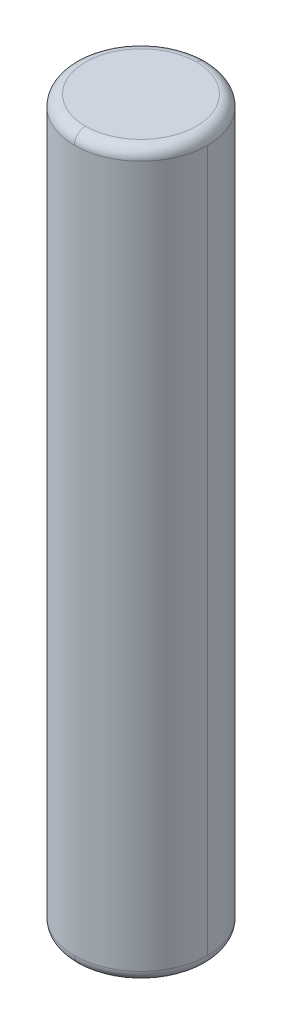
ISO-10303-21;
HEADER;
FILE_DESCRIPTION(('STEP AP214'),'2;1');
FILE_NAME('part.step','',(''),(''),'','','');
FILE_SCHEMA(('AUTOMOTIVE_DESIGN { 1 0 10303 214 1 1 1 1 }'));
ENDSEC;
DATA;
#1=APPLICATION_CONTEXT('core data for automotive mechanical design processes');
#2=APPLICATION_PROTOCOL_DEFINITION('international standard','automotive_design',2000,#1);
#3=PRODUCT_CONTEXT('',#1,'mechanical');
#4=PRODUCT('Part','Part','',(#3));
#5=PRODUCT_RELATED_PRODUCT_CATEGORY('part','',(#4));
#6=PRODUCT_DEFINITION_FORMATION('','',#4);
#7=PRODUCT_DEFINITION_CONTEXT('part definition',#1,'design');
#8=PRODUCT_DEFINITION('design','',#6,#7);
#9=PRODUCT_DEFINITION_SHAPE('','',#8);
#10=(LENGTH_UNIT() NAMED_UNIT(*) SI_UNIT(.MILLI.,.METRE.));
#11=(NAMED_UNIT(*) PLANE_ANGLE_UNIT() SI_UNIT($,.RADIAN.));
#12=(NAMED_UNIT(*) SI_UNIT($,.STERADIAN.) SOLID_ANGLE_UNIT());
#13=UNCERTAINTY_MEASURE_WITH_UNIT(LENGTH_MEASURE(1.E-05),#10,'distance_accuracy_value','');
#14=(GEOMETRIC_REPRESENTATION_CONTEXT(3) GLOBAL_UNCERTAINTY_ASSIGNED_CONTEXT((#13)) GLOBAL_UNIT_ASSIGNED_CONTEXT((#10,
#11,#12)) REPRESENTATION_CONTEXT('',''));
#15=CARTESIAN_POINT('',(0.,0.,0.));
#16=DIRECTION('',(0.,0.,1.));
#17=DIRECTION('',(1.,0.,0.));
#18=AXIS2_PLACEMENT_3D('',#15,#16,#17);
#19=CARTESIAN_POINT('',(16.2500000708053,-4.30409112274651,-11.));
#20=DIRECTION('',(0.,1.,0.));
#21=DIRECTION('',(0.,0.,1.));
#22=AXIS2_PLACEMENT_3D('',#19,#20,#21);
#23=TOROIDAL_SURFACE('',#22,1.25,0.25);
#24=CARTESIAN_POINT('',(16.2500000708053,-4.30409112274651,-12.25));
#25=DIRECTION('',(1.,0.,0.));
#26=DIRECTION('',(0.,0.,-1.));
#27=AXIS2_PLACEMENT_3D('',#24,#25,#26);
#28=CIRCLE('',#27,0.25);
#29=CARTESIAN_POINT('',(16.2500000708053,-4.30409112274651,-12.5));
#30=VERTEX_POINT('',#29);
#31=CARTESIAN_POINT('',(16.2500000708053,-4.05409112274651,-12.25));
#32=VERTEX_POINT('',#31);
#33=EDGE_CURVE('E112',#30,#32,#28,.T.);
#34=ORIENTED_EDGE('',*,*,#33,.F.);
#35=CARTESIAN_POINT('',(16.2500000708053,-4.30409112274651,-11.));
#36=DIRECTION('',(0.,1.,0.));
#37=DIRECTION('',(1.,0.,0.));
#38=AXIS2_PLACEMENT_3D('',#35,#36,#37);
#39=CIRCLE('',#38,1.5);
#40=CARTESIAN_POINT('',(14.7500000708053,-4.30409112274651,-11.));
#41=VERTEX_POINT('',#40);
#42=EDGE_CURVE('E86',#30,#41,#39,.T.);
#43=ORIENTED_EDGE('',*,*,#42,.T.);
#44=CARTESIAN_POINT('',(16.2500000708053,-4.30409112274651,-11.));
#45=DIRECTION('',(0.,1.,0.));
#46=DIRECTION('',(1.,0.,0.));
#47=AXIS2_PLACEMENT_3D('',#44,#45,#46);
#48=CIRCLE('',#47,1.5);
#49=CARTESIAN_POINT('',(16.2500000708053,-4.30409112274651,-9.5));
#50=VERTEX_POINT('',#49);
#51=EDGE_CURVE('E11',#41,#50,#48,.T.);
#52=ORIENTED_EDGE('',*,*,#51,.T.);
#53=CARTESIAN_POINT('',(16.2500000708053,-4.30409112274651,-9.75));
#54=DIRECTION('',(-1.,0.,0.));
#55=DIRECTION('',(0.,-1.,0.));
#56=AXIS2_PLACEMENT_3D('',#53,#54,#55);
#57=CIRCLE('',#56,0.25);
#58=CARTESIAN_POINT('',(16.2500000708053,-4.05409112274651,-9.75));
#59=VERTEX_POINT('',#58);
#60=EDGE_CURVE('E83',#50,#59,#57,.T.);
#61=ORIENTED_EDGE('',*,*,#60,.T.);
#62=CARTESIAN_POINT('',(16.2500000708053,-4.05409112274651,-11.));
#63=DIRECTION('',(0.,-1.,0.));
#64=DIRECTION('',(1.,0.,0.));
#65=AXIS2_PLACEMENT_3D('',#62,#63,#64);
#66=CIRCLE('',#65,1.25);
#67=EDGE_CURVE('E28',#59,#32,#66,.T.);
#68=ORIENTED_EDGE('',*,*,#67,.T.);
#69=EDGE_LOOP('',(#34,#43,#52,#61,#68));
#70=FACE_BOUND('',#69,.T.);
#71=ADVANCED_FACE('F17',(#70),#23,.T.);
#72=CARTESIAN_POINT('',(16.2500000708053,-25.2,-11.));
#73=DIRECTION('',(0.,1.,0.));
#74=DIRECTION('',(1.,0.,0.));
#75=AXIS2_PLACEMENT_3D('',#72,#73,#74);
#76=CYLINDRICAL_SURFACE('',#75,1.5);
#77=DIRECTION('',(0.,1.,0.));
#78=VECTOR('',#77,1.);
#79=CARTESIAN_POINT('',(14.7500000708053,-25.2,-11.));
#80=LINE('',#79,#78);
#81=CARTESIAN_POINT('',(14.7500000708053,-20.1040909633041,-11.));
#82=VERTEX_POINT('',#81);
#83=EDGE_CURVE('E125',#82,#41,#80,.T.);
#84=ORIENTED_EDGE('',*,*,#83,.F.);
#85=CARTESIAN_POINT('',(16.2500000708053,-20.1040909633041,-11.));
#86=DIRECTION('',(0.,-1.,0.));
#87=DIRECTION('',(1.,0.,0.));
#88=AXIS2_PLACEMENT_3D('',#85,#86,#87);
#89=CIRCLE('',#88,1.5);
#90=CARTESIAN_POINT('',(16.2500000708053,-20.1040909633041,-9.5));
#91=VERTEX_POINT('',#90);
#92=EDGE_CURVE('E118',#91,#82,#89,.T.);
#93=ORIENTED_EDGE('',*,*,#92,.F.);
#94=CARTESIAN_POINT('',(16.2500000708053,-20.1040909633041,-11.));
#95=DIRECTION('',(0.,-1.,0.));
#96=DIRECTION('',(1.,0.,0.));
#97=AXIS2_PLACEMENT_3D('',#94,#95,#96);
#98=CIRCLE('',#97,1.5);
#99=CARTESIAN_POINT('',(17.7500000708053,-20.1040909633041,-11.));
#100=VERTEX_POINT('',#99);
#101=EDGE_CURVE('E145',#100,#91,#98,.T.);
#102=ORIENTED_EDGE('',*,*,#101,.F.);
#103=DIRECTION('',(0.,1.,0.));
#104=VECTOR('',#103,1.);
#105=CARTESIAN_POINT('',(17.7500000708053,-25.2,-11.));
#106=LINE('',#105,#104);
#107=CARTESIAN_POINT('',(17.7500000708053,-4.30409112274651,-11.));
#108=VERTEX_POINT('',#107);
#109=EDGE_CURVE('E94',#100,#108,#106,.T.);
#110=ORIENTED_EDGE('',*,*,#109,.T.);
#111=CARTESIAN_POINT('',(16.2500000708053,-4.30409112274651,-11.));
#112=DIRECTION('',(0.,1.,0.));
#113=DIRECTION('',(1.,0.,0.));
#114=AXIS2_PLACEMENT_3D('',#111,#112,#113);
#115=CIRCLE('',#114,1.5);
#116=EDGE_CURVE('E91',#50,#108,#115,.T.);
#117=ORIENTED_EDGE('',*,*,#116,.F.);
#118=ORIENTED_EDGE('',*,*,#51,.F.);
#119=EDGE_LOOP('',(#84,#93,#102,#110,#117,#118));
#120=FACE_BOUND('',#119,.T.);
#121=ADVANCED_FACE('F92',(#120),#76,.T.);
#122=CARTESIAN_POINT('',(16.2500000708053,-4.05409112274651,-11.));
#123=DIRECTION('',(0.,-1.,0.));
#124=DIRECTION('',(-1.,0.,0.));
#125=AXIS2_PLACEMENT_3D('',#122,#123,#124);
#126=PLANE('',#125);
#127=ORIENTED_EDGE('',*,*,#67,.F.);
#128=CARTESIAN_POINT('',(16.2500000708053,-4.05409112274651,-11.));
#129=DIRECTION('',(0.,-1.,0.));
#130=DIRECTION('',(1.,0.,0.));
#131=AXIS2_PLACEMENT_3D('',#128,#129,#130);
#132=CIRCLE('',#131,1.25);
#133=EDGE_CURVE('E104',#32,#59,#132,.T.);
#134=ORIENTED_EDGE('',*,*,#133,.F.);
#135=EDGE_LOOP('',(#127,#134));
#136=FACE_BOUND('',#135,.T.);
#137=ADVANCED_FACE('F249',(#136),#126,.F.);
#138=CARTESIAN_POINT('',(16.2500000708053,-20.1040909633041,-11.));
#139=DIRECTION('',(0.,-1.,0.));
#140=DIRECTION('',(0.,0.,-1.));
#141=AXIS2_PLACEMENT_3D('',#138,#139,#140);
#142=TOROIDAL_SURFACE('',#141,1.25,0.25);
#143=CARTESIAN_POINT('',(16.2500000708053,-20.1040909633041,-9.75));
#144=DIRECTION('',(1.,0.,0.));
#145=DIRECTION('',(0.,0.,-1.));
#146=AXIS2_PLACEMENT_3D('',#143,#144,#145);
#147=CIRCLE('',#146,0.25);
#148=CARTESIAN_POINT('',(16.2500000708053,-20.354090963304,-9.75));
#149=VERTEX_POINT('',#148);
#150=EDGE_CURVE('E116',#91,#149,#147,.T.);
#151=ORIENTED_EDGE('',*,*,#150,.F.);
#152=ORIENTED_EDGE('',*,*,#92,.T.);
#153=CARTESIAN_POINT('',(16.2500000708053,-20.1040909633041,-11.));
#154=DIRECTION('',(0.,-1.,0.));
#155=DIRECTION('',(1.,0.,0.));
#156=AXIS2_PLACEMENT_3D('',#153,#154,#155);
#157=CIRCLE('',#156,1.5);
#158=CARTESIAN_POINT('',(16.2500000708053,-20.1040909633041,-12.5));
#159=VERTEX_POINT('',#158);
#160=EDGE_CURVE('E99',#82,#159,#157,.T.);
#161=ORIENTED_EDGE('',*,*,#160,.T.);
#162=CARTESIAN_POINT('',(16.2500000708053,-20.1040909633041,-12.25));
#163=DIRECTION('',(-1.,0.,0.));
#164=DIRECTION('',(0.,-1.,0.));
#165=AXIS2_PLACEMENT_3D('',#162,#163,#164);
#166=CIRCLE('',#165,0.25);
#167=CARTESIAN_POINT('',(16.2500000708053,-20.354090963304,-12.25));
#168=VERTEX_POINT('',#167);
#169=EDGE_CURVE('E127',#159,#168,#166,.T.);
#170=ORIENTED_EDGE('',*,*,#169,.T.);
#171=CARTESIAN_POINT('',(16.2500000708053,-20.354090963304,-11.));
#172=DIRECTION('',(0.,1.,0.));
#173=DIRECTION('',(1.,0.,0.));
#174=AXIS2_PLACEMENT_3D('',#171,#172,#173);
#175=CIRCLE('',#174,1.25);
#176=EDGE_CURVE('E21',#168,#149,#175,.T.);
#177=ORIENTED_EDGE('',*,*,#176,.T.);
#178=EDGE_LOOP('',(#151,#152,#161,#170,#177));
#179=FACE_BOUND('',#178,.T.);
#180=ADVANCED_FACE('F19',(#179),#142,.T.);
#181=CARTESIAN_POINT('',(16.2500000708053,-20.354090963304,-11.));
#182=DIRECTION('',(0.,-1.,0.));
#183=DIRECTION('',(-1.,0.,0.));
#184=AXIS2_PLACEMENT_3D('',#181,#182,#183);
#185=PLANE('',#184);
#186=ORIENTED_EDGE('',*,*,#176,.F.);
#187=CARTESIAN_POINT('',(16.2500000708053,-20.354090963304,-11.));
#188=DIRECTION('',(0.,1.,0.));
#189=DIRECTION('',(1.,0.,0.));
#190=AXIS2_PLACEMENT_3D('',#187,#188,#189);
#191=CIRCLE('',#190,1.25);
#192=EDGE_CURVE('E129',#149,#168,#191,.T.);
#193=ORIENTED_EDGE('',*,*,#192,.F.);
#194=EDGE_LOOP('',(#186,#193));
#195=FACE_BOUND('',#194,.T.);
#196=ADVANCED_FACE('F223',(#195),#185,.T.);
#197=CARTESIAN_POINT('',(16.2500000708053,-20.1040909633041,-11.));
#198=DIRECTION('',(0.,-1.,0.));
#199=DIRECTION('',(0.,0.,-1.));
#200=AXIS2_PLACEMENT_3D('',#197,#198,#199);
#201=TOROIDAL_SURFACE('',#200,1.25,0.25);
#202=CARTESIAN_POINT('',(16.2500000708053,-20.1040909633041,-11.));
#203=DIRECTION('',(0.,-1.,0.));
#204=DIRECTION('',(1.,0.,0.));
#205=AXIS2_PLACEMENT_3D('',#202,#203,#204);
#206=CIRCLE('',#205,1.5);
#207=EDGE_CURVE('E161',#159,#100,#206,.T.);
#208=ORIENTED_EDGE('',*,*,#207,.T.);
#209=ORIENTED_EDGE('',*,*,#101,.T.);
#210=ORIENTED_EDGE('',*,*,#150,.T.);
#211=ORIENTED_EDGE('',*,*,#192,.T.);
#212=ORIENTED_EDGE('',*,*,#169,.F.);
#213=EDGE_LOOP('',(#208,#209,#210,#211,#212));
#214=FACE_BOUND('',#213,.T.);
#215=ADVANCED_FACE('F219',(#214),#201,.T.);
#216=CARTESIAN_POINT('',(16.2500000708053,-25.2,-11.));
#217=DIRECTION('',(0.,1.,0.));
#218=DIRECTION('',(1.,0.,0.));
#219=AXIS2_PLACEMENT_3D('',#216,#217,#218);
#220=CYLINDRICAL_SURFACE('',#219,1.5);
#221=ORIENTED_EDGE('',*,*,#160,.F.);
#222=ORIENTED_EDGE('',*,*,#83,.T.);
#223=ORIENTED_EDGE('',*,*,#42,.F.);
#224=CARTESIAN_POINT('',(16.2500000708053,-4.30409112274651,-11.));
#225=DIRECTION('',(0.,1.,0.));
#226=DIRECTION('',(1.,0.,0.));
#227=AXIS2_PLACEMENT_3D('',#224,#225,#226);
#228=CIRCLE('',#227,1.5);
#229=EDGE_CURVE('E124',#108,#30,#228,.T.);
#230=ORIENTED_EDGE('',*,*,#229,.F.);
#231=ORIENTED_EDGE('',*,*,#109,.F.);
#232=ORIENTED_EDGE('',*,*,#207,.F.);
#233=EDGE_LOOP('',(#221,#222,#223,#230,#231,#232));
#234=FACE_BOUND('',#233,.T.);
#235=ADVANCED_FACE('F159',(#234),#220,.T.);
#236=CARTESIAN_POINT('',(16.2500000708053,-4.30409112274651,-11.));
#237=DIRECTION('',(0.,1.,0.));
#238=DIRECTION('',(0.,0.,1.));
#239=AXIS2_PLACEMENT_3D('',#236,#237,#238);
#240=TOROIDAL_SURFACE('',#239,1.25,0.25);
#241=ORIENTED_EDGE('',*,*,#229,.T.);
#242=ORIENTED_EDGE('',*,*,#33,.T.);
#243=ORIENTED_EDGE('',*,*,#133,.T.);
#244=ORIENTED_EDGE('',*,*,#60,.F.);
#245=ORIENTED_EDGE('',*,*,#116,.T.);
#246=EDGE_LOOP('',(#241,#242,#243,#244,#245));
#247=FACE_BOUND('',#246,.T.);
#248=ADVANCED_FACE('F101',(#247),#240,.T.);
#249=CLOSED_SHELL('',(#71,#121,#137,#180,#196,#215,#235,#248));
#250=MANIFOLD_SOLID_BREP('B1',#249);
#251=ADVANCED_BREP_SHAPE_REPRESENTATION('',(#18,#250),#14);
#252=SHAPE_DEFINITION_REPRESENTATION(#9,#251);
ENDSEC;
END-ISO-10303-21;
